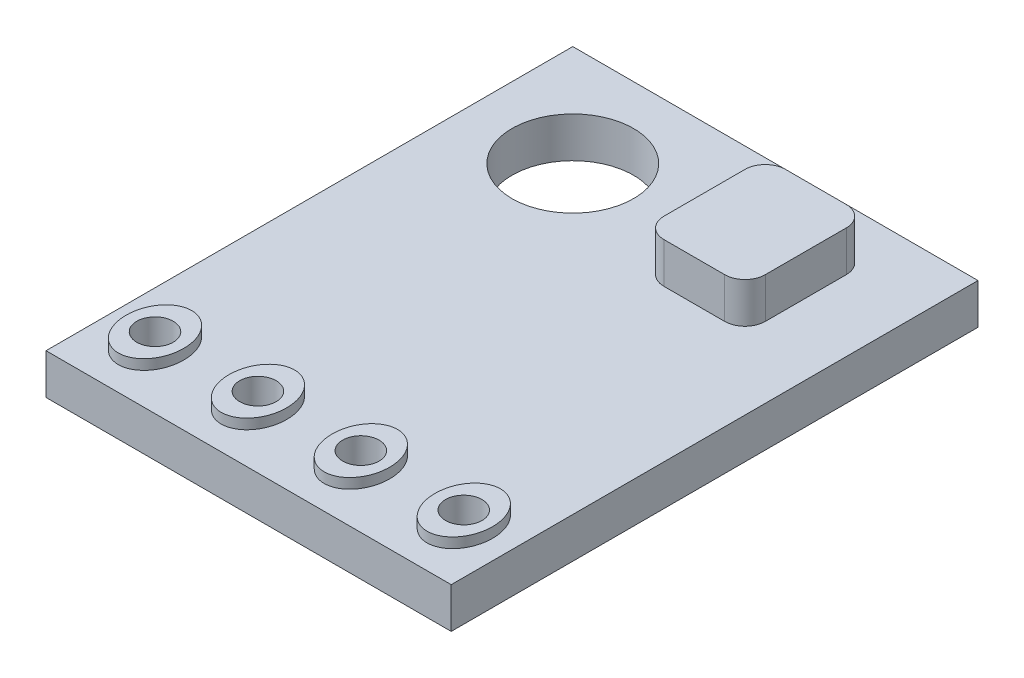
ISO-10303-21;
HEADER;
FILE_DESCRIPTION(('STEP AP214'),'2;1');
FILE_NAME('part.step','',(''),(''),'','','');
FILE_SCHEMA(('AUTOMOTIVE_DESIGN { 1 0 10303 214 1 1 1 1 }'));
ENDSEC;
DATA;
#1=APPLICATION_CONTEXT('core data for automotive mechanical design processes');
#2=APPLICATION_PROTOCOL_DEFINITION('international standard','automotive_design',2000,#1);
#3=PRODUCT_CONTEXT('',#1,'mechanical');
#4=PRODUCT('Part','Part','',(#3));
#5=PRODUCT_RELATED_PRODUCT_CATEGORY('part','',(#4));
#6=PRODUCT_DEFINITION_FORMATION('','',#4);
#7=PRODUCT_DEFINITION_CONTEXT('part definition',#1,'design');
#8=PRODUCT_DEFINITION('design','',#6,#7);
#9=PRODUCT_DEFINITION_SHAPE('','',#8);
#10=(LENGTH_UNIT() NAMED_UNIT(*) SI_UNIT(.MILLI.,.METRE.));
#11=(NAMED_UNIT(*) PLANE_ANGLE_UNIT() SI_UNIT($,.RADIAN.));
#12=(NAMED_UNIT(*) SI_UNIT($,.STERADIAN.) SOLID_ANGLE_UNIT());
#13=UNCERTAINTY_MEASURE_WITH_UNIT(LENGTH_MEASURE(1.E-05),#10,'distance_accuracy_value','');
#14=(GEOMETRIC_REPRESENTATION_CONTEXT(3) GLOBAL_UNCERTAINTY_ASSIGNED_CONTEXT((#13)) GLOBAL_UNIT_ASSIGNED_CONTEXT((#10,
#11,#12)) REPRESENTATION_CONTEXT('',''));
#15=CARTESIAN_POINT('',(0.,0.,0.));
#16=DIRECTION('',(0.,0.,1.));
#17=DIRECTION('',(1.,0.,0.));
#18=AXIS2_PLACEMENT_3D('',#15,#16,#17);
#19=CARTESIAN_POINT('',(0.,1.,0.));
#20=DIRECTION('',(0.,1.,0.));
#21=DIRECTION('',(0.,0.,1.));
#22=AXIS2_PLACEMENT_3D('',#19,#20,#21);
#23=PLANE('',#22);
#24=CARTESIAN_POINT('',(1.27,1.,5.));
#25=DIRECTION('',(0.,1.,0.));
#26=DIRECTION('',(0.,0.,1.));
#27=AXIS2_PLACEMENT_3D('',#24,#25,#26);
#28=ELLIPSE('',#27,0.905906642383663,0.710654865542892);
#29=CARTESIAN_POINT('',(1.27,1.,5.90590664238366));
#30=VERTEX_POINT('',#29);
#31=EDGE_CURVE('E376',#30,#30,#28,.F.);
#32=ORIENTED_EDGE('',*,*,#31,.T.);
#33=EDGE_LOOP('',(#32));
#34=FACE_BOUND('',#33,.T.);
#35=CARTESIAN_POINT('',(3.81,1.,5.));
#36=DIRECTION('',(0.,1.,0.));
#37=DIRECTION('',(0.,0.,1.));
#38=AXIS2_PLACEMENT_3D('',#35,#36,#37);
#39=ELLIPSE('',#38,0.905906642383663,0.710654865542892);
#40=CARTESIAN_POINT('',(3.81,1.,5.90590664238366));
#41=VERTEX_POINT('',#40);
#42=EDGE_CURVE('E402',#41,#41,#39,.F.);
#43=ORIENTED_EDGE('',*,*,#42,.T.);
#44=EDGE_LOOP('',(#43));
#45=FACE_BOUND('',#44,.T.);
#46=CARTESIAN_POINT('',(-1.27,1.,5.));
#47=DIRECTION('',(0.,1.,0.));
#48=DIRECTION('',(0.,0.,1.));
#49=AXIS2_PLACEMENT_3D('',#46,#47,#48);
#50=ELLIPSE('',#49,0.905906642383663,0.710654865542892);
#51=CARTESIAN_POINT('',(-1.27,1.,5.90590664238366));
#52=VERTEX_POINT('',#51);
#53=EDGE_CURVE('E334',#52,#52,#50,.F.);
#54=ORIENTED_EDGE('',*,*,#53,.T.);
#55=EDGE_LOOP('',(#54));
#56=FACE_BOUND('',#55,.T.);
#57=CARTESIAN_POINT('',(-3.81,1.,5.));
#58=DIRECTION('',(0.,1.,0.));
#59=DIRECTION('',(0.,0.,1.));
#60=AXIS2_PLACEMENT_3D('',#57,#58,#59);
#61=ELLIPSE('',#60,0.905906642383663,0.710654865542892);
#62=CARTESIAN_POINT('',(-3.81,1.,5.90590664238366));
#63=VERTEX_POINT('',#62);
#64=EDGE_CURVE('E158',#63,#63,#61,.F.);
#65=ORIENTED_EDGE('',*,*,#64,.T.);
#66=EDGE_LOOP('',(#65));
#67=FACE_BOUND('',#66,.T.);
#68=DIRECTION('',(0.,0.,-1.));
#69=VECTOR('',#68,1.);
#70=CARTESIAN_POINT('',(5.,1.,-6.5));
#71=LINE('',#70,#69);
#72=CARTESIAN_POINT('',(5.,1.,6.5));
#73=VERTEX_POINT('',#72);
#74=CARTESIAN_POINT('',(5.,1.,-6.5));
#75=VERTEX_POINT('',#74);
#76=EDGE_CURVE('E196',#73,#75,#71,.T.);
#77=ORIENTED_EDGE('',*,*,#76,.T.);
#78=DIRECTION('',(-1.,0.,0.));
#79=VECTOR('',#78,1.);
#80=CARTESIAN_POINT('',(-5.,1.,-6.5));
#81=LINE('',#80,#79);
#82=CARTESIAN_POINT('',(-5.,1.,-6.5));
#83=VERTEX_POINT('',#82);
#84=EDGE_CURVE('E92',#75,#83,#81,.T.);
#85=ORIENTED_EDGE('',*,*,#84,.T.);
#86=DIRECTION('',(0.,0.,1.));
#87=VECTOR('',#86,1.);
#88=CARTESIAN_POINT('',(-5.,1.,-6.5));
#89=LINE('',#88,#87);
#90=CARTESIAN_POINT('',(-5.,1.,6.5));
#91=VERTEX_POINT('',#90);
#92=EDGE_CURVE('E199',#83,#91,#89,.T.);
#93=ORIENTED_EDGE('',*,*,#92,.T.);
#94=DIRECTION('',(1.,0.,0.));
#95=VECTOR('',#94,1.);
#96=CARTESIAN_POINT('',(-5.,1.,6.5));
#97=LINE('',#96,#95);
#98=EDGE_CURVE('E64',#91,#73,#97,.T.);
#99=ORIENTED_EDGE('',*,*,#98,.T.);
#100=EDGE_LOOP('',(#77,#85,#93,#99));
#101=FACE_BOUND('',#100,.T.);
#102=CARTESIAN_POINT('',(-2.5,1.,-4.));
#103=DIRECTION('',(0.,1.,0.));
#104=DIRECTION('',(0.,0.,1.));
#105=AXIS2_PLACEMENT_3D('',#102,#103,#104);
#106=CIRCLE('',#105,1.5);
#107=CARTESIAN_POINT('',(-2.5,1.,-2.5));
#108=VERTEX_POINT('',#107);
#109=EDGE_CURVE('E190',#108,#108,#106,.T.);
#110=ORIENTED_EDGE('',*,*,#109,.F.);
#111=EDGE_LOOP('',(#110));
#112=FACE_BOUND('',#111,.T.);
#113=DIRECTION('',(-1.,0.,0.));
#114=VECTOR('',#113,1.);
#115=CARTESIAN_POINT('',(0.,1.,-2.5));
#116=LINE('',#115,#114);
#117=CARTESIAN_POINT('',(2.75,1.,-2.5));
#118=VERTEX_POINT('',#117);
#119=CARTESIAN_POINT('',(1.25,1.,-2.5));
#120=VERTEX_POINT('',#119);
#121=EDGE_CURVE('E186',#118,#120,#116,.T.);
#122=ORIENTED_EDGE('',*,*,#121,.T.);
#123=CARTESIAN_POINT('',(1.25,1.,-3.));
#124=DIRECTION('',(0.,1.,0.));
#125=DIRECTION('',(0.,0.,1.));
#126=AXIS2_PLACEMENT_3D('',#123,#124,#125);
#127=CIRCLE('',#126,0.5);
#128=CARTESIAN_POINT('',(0.749999999999998,1.,-3.));
#129=VERTEX_POINT('',#128);
#130=EDGE_CURVE('E162',#120,#129,#127,.F.);
#131=ORIENTED_EDGE('',*,*,#130,.T.);
#132=DIRECTION('',(0.,0.,-1.));
#133=VECTOR('',#132,1.);
#134=CARTESIAN_POINT('',(0.749999999999999,1.,0.));
#135=LINE('',#134,#133);
#136=CARTESIAN_POINT('',(0.749999999999998,1.,-5.));
#137=VERTEX_POINT('',#136);
#138=EDGE_CURVE('E163',#129,#137,#135,.T.);
#139=ORIENTED_EDGE('',*,*,#138,.T.);
#140=CARTESIAN_POINT('',(1.25,1.,-5.));
#141=DIRECTION('',(0.,1.,0.));
#142=DIRECTION('',(0.,0.,1.));
#143=AXIS2_PLACEMENT_3D('',#140,#141,#142);
#144=CIRCLE('',#143,0.5);
#145=CARTESIAN_POINT('',(1.25,1.,-5.5));
#146=VERTEX_POINT('',#145);
#147=EDGE_CURVE('E166',#137,#146,#144,.F.);
#148=ORIENTED_EDGE('',*,*,#147,.T.);
#149=DIRECTION('',(1.,0.,0.));
#150=VECTOR('',#149,1.);
#151=CARTESIAN_POINT('',(0.,1.,-5.5));
#152=LINE('',#151,#150);
#153=CARTESIAN_POINT('',(2.74999999999999,1.,-5.5));
#154=VERTEX_POINT('',#153);
#155=EDGE_CURVE('E174',#146,#154,#152,.T.);
#156=ORIENTED_EDGE('',*,*,#155,.T.);
#157=CARTESIAN_POINT('',(2.75,1.,-5.));
#158=DIRECTION('',(0.,1.,0.));
#159=DIRECTION('',(0.,0.,1.));
#160=AXIS2_PLACEMENT_3D('',#157,#158,#159);
#161=CIRCLE('',#160,0.5);
#162=CARTESIAN_POINT('',(3.25,1.,-5.));
#163=VERTEX_POINT('',#162);
#164=EDGE_CURVE('E177',#154,#163,#161,.F.);
#165=ORIENTED_EDGE('',*,*,#164,.T.);
#166=DIRECTION('',(0.,0.,1.));
#167=VECTOR('',#166,1.);
#168=CARTESIAN_POINT('',(3.25,1.,0.));
#169=LINE('',#168,#167);
#170=CARTESIAN_POINT('',(3.25,1.,-3.));
#171=VERTEX_POINT('',#170);
#172=EDGE_CURVE('E180',#163,#171,#169,.T.);
#173=ORIENTED_EDGE('',*,*,#172,.T.);
#174=CARTESIAN_POINT('',(2.75,1.,-3.));
#175=DIRECTION('',(0.,1.,0.));
#176=DIRECTION('',(0.,0.,1.));
#177=AXIS2_PLACEMENT_3D('',#174,#175,#176);
#178=CIRCLE('',#177,0.5);
#179=EDGE_CURVE('E183',#171,#118,#178,.F.);
#180=ORIENTED_EDGE('',*,*,#179,.T.);
#181=EDGE_LOOP('',(#122,#131,#139,#148,#156,#165,#173,#180));
#182=FACE_BOUND('',#181,.T.);
#183=ADVANCED_FACE('F40',(#34,#45,#56,#67,#101,#112,#182),#23,.T.);
#184=CARTESIAN_POINT('',(0.,0.,0.));
#185=DIRECTION('',(0.,1.,0.));
#186=DIRECTION('',(0.,0.,1.));
#187=AXIS2_PLACEMENT_3D('',#184,#185,#186);
#188=PLANE('',#187);
#189=CARTESIAN_POINT('',(-3.81,0.,5.));
#190=DIRECTION('',(0.,1.,0.));
#191=DIRECTION('',(0.,0.,1.));
#192=AXIS2_PLACEMENT_3D('',#189,#190,#191);
#193=CIRCLE('',#192,0.45);
#194=CARTESIAN_POINT('',(-3.81,0.,5.45));
#195=VERTEX_POINT('',#194);
#196=EDGE_CURVE('E361',#195,#195,#193,.F.);
#197=ORIENTED_EDGE('',*,*,#196,.F.);
#198=EDGE_LOOP('',(#197));
#199=FACE_BOUND('',#198,.T.);
#200=CARTESIAN_POINT('',(-1.27,0.,5.));
#201=DIRECTION('',(0.,1.,0.));
#202=DIRECTION('',(0.,0.,1.));
#203=AXIS2_PLACEMENT_3D('',#200,#201,#202);
#204=CIRCLE('',#203,0.45);
#205=CARTESIAN_POINT('',(-1.27,0.,5.45));
#206=VERTEX_POINT('',#205);
#207=EDGE_CURVE('E363',#206,#206,#204,.F.);
#208=ORIENTED_EDGE('',*,*,#207,.F.);
#209=EDGE_LOOP('',(#208));
#210=FACE_BOUND('',#209,.T.);
#211=CARTESIAN_POINT('',(1.27,0.,5.));
#212=DIRECTION('',(0.,1.,0.));
#213=DIRECTION('',(0.,0.,1.));
#214=AXIS2_PLACEMENT_3D('',#211,#212,#213);
#215=CIRCLE('',#214,0.45);
#216=CARTESIAN_POINT('',(1.27,0.,5.45));
#217=VERTEX_POINT('',#216);
#218=EDGE_CURVE('E418',#217,#217,#215,.F.);
#219=ORIENTED_EDGE('',*,*,#218,.F.);
#220=EDGE_LOOP('',(#219));
#221=FACE_BOUND('',#220,.T.);
#222=CARTESIAN_POINT('',(3.81,0.,5.));
#223=DIRECTION('',(0.,1.,0.));
#224=DIRECTION('',(0.,0.,1.));
#225=AXIS2_PLACEMENT_3D('',#222,#223,#224);
#226=CIRCLE('',#225,0.450000000000001);
#227=CARTESIAN_POINT('',(3.81,0.,5.45));
#228=VERTEX_POINT('',#227);
#229=EDGE_CURVE('E369',#228,#228,#226,.F.);
#230=ORIENTED_EDGE('',*,*,#229,.F.);
#231=EDGE_LOOP('',(#230));
#232=FACE_BOUND('',#231,.T.);
#233=CARTESIAN_POINT('',(-2.5,0.,-4.));
#234=DIRECTION('',(0.,1.,0.));
#235=DIRECTION('',(0.,0.,1.));
#236=AXIS2_PLACEMENT_3D('',#233,#234,#235);
#237=CIRCLE('',#236,1.5);
#238=CARTESIAN_POINT('',(-2.5,0.,-2.5));
#239=VERTEX_POINT('',#238);
#240=EDGE_CURVE('E189',#239,#239,#237,.T.);
#241=ORIENTED_EDGE('',*,*,#240,.T.);
#242=EDGE_LOOP('',(#241));
#243=FACE_BOUND('',#242,.T.);
#244=DIRECTION('',(0.,0.,-1.));
#245=VECTOR('',#244,1.);
#246=CARTESIAN_POINT('',(5.,0.,-6.5));
#247=LINE('',#246,#245);
#248=CARTESIAN_POINT('',(5.,0.,6.5));
#249=VERTEX_POINT('',#248);
#250=CARTESIAN_POINT('',(5.,0.,-6.5));
#251=VERTEX_POINT('',#250);
#252=EDGE_CURVE('E193',#249,#251,#247,.T.);
#253=ORIENTED_EDGE('',*,*,#252,.F.);
#254=DIRECTION('',(1.,0.,0.));
#255=VECTOR('',#254,1.);
#256=CARTESIAN_POINT('',(-5.,0.,6.5));
#257=LINE('',#256,#255);
#258=CARTESIAN_POINT('',(-5.,0.,6.5));
#259=VERTEX_POINT('',#258);
#260=EDGE_CURVE('E85',#259,#249,#257,.T.);
#261=ORIENTED_EDGE('',*,*,#260,.F.);
#262=DIRECTION('',(0.,0.,1.));
#263=VECTOR('',#262,1.);
#264=CARTESIAN_POINT('',(-5.,0.,-6.5));
#265=LINE('',#264,#263);
#266=CARTESIAN_POINT('',(-5.,0.,-6.5));
#267=VERTEX_POINT('',#266);
#268=EDGE_CURVE('E207',#267,#259,#265,.T.);
#269=ORIENTED_EDGE('',*,*,#268,.F.);
#270=DIRECTION('',(-1.,0.,0.));
#271=VECTOR('',#270,1.);
#272=CARTESIAN_POINT('',(-5.,0.,-6.5));
#273=LINE('',#272,#271);
#274=EDGE_CURVE('E205',#251,#267,#273,.T.);
#275=ORIENTED_EDGE('',*,*,#274,.F.);
#276=EDGE_LOOP('',(#253,#261,#269,#275));
#277=FACE_BOUND('',#276,.T.);
#278=ADVANCED_FACE('F220',(#199,#210,#221,#232,#243,#277),#188,.F.);
#279=CARTESIAN_POINT('',(5.,1.,-6.5));
#280=DIRECTION('',(-1.,0.,0.));
#281=DIRECTION('',(0.,0.,1.));
#282=AXIS2_PLACEMENT_3D('',#279,#280,#281);
#283=PLANE('',#282);
#284=ORIENTED_EDGE('',*,*,#252,.T.);
#285=DIRECTION('',(0.,-1.,0.));
#286=VECTOR('',#285,1.);
#287=CARTESIAN_POINT('',(5.,1.,-6.5));
#288=LINE('',#287,#286);
#289=EDGE_CURVE('E11',#75,#251,#288,.T.);
#290=ORIENTED_EDGE('',*,*,#289,.F.);
#291=ORIENTED_EDGE('',*,*,#76,.F.);
#292=DIRECTION('',(0.,-1.,0.));
#293=VECTOR('',#292,1.);
#294=CARTESIAN_POINT('',(5.,1.,6.5));
#295=LINE('',#294,#293);
#296=EDGE_CURVE('E202',#73,#249,#295,.T.);
#297=ORIENTED_EDGE('',*,*,#296,.T.);
#298=EDGE_LOOP('',(#284,#290,#291,#297));
#299=FACE_BOUND('',#298,.T.);
#300=ADVANCED_FACE('F42',(#299),#283,.F.);
#301=CARTESIAN_POINT('',(-5.,1.,-6.5));
#302=DIRECTION('',(0.,0.,1.));
#303=DIRECTION('',(1.,0.,0.));
#304=AXIS2_PLACEMENT_3D('',#301,#302,#303);
#305=PLANE('',#304);
#306=ORIENTED_EDGE('',*,*,#274,.T.);
#307=DIRECTION('',(0.,-1.,0.));
#308=VECTOR('',#307,1.);
#309=CARTESIAN_POINT('',(-5.,1.,-6.5));
#310=LINE('',#309,#308);
#311=EDGE_CURVE('E48',#83,#267,#310,.T.);
#312=ORIENTED_EDGE('',*,*,#311,.F.);
#313=ORIENTED_EDGE('',*,*,#84,.F.);
#314=ORIENTED_EDGE('',*,*,#289,.T.);
#315=EDGE_LOOP('',(#306,#312,#313,#314));
#316=FACE_BOUND('',#315,.T.);
#317=ADVANCED_FACE('F234',(#316),#305,.F.);
#318=CARTESIAN_POINT('',(-5.,1.,-6.5));
#319=DIRECTION('',(1.,0.,0.));
#320=DIRECTION('',(0.,0.,-1.));
#321=AXIS2_PLACEMENT_3D('',#318,#319,#320);
#322=PLANE('',#321);
#323=ORIENTED_EDGE('',*,*,#268,.T.);
#324=DIRECTION('',(0.,-1.,0.));
#325=VECTOR('',#324,1.);
#326=CARTESIAN_POINT('',(-5.,1.,6.5));
#327=LINE('',#326,#325);
#328=EDGE_CURVE('E211',#91,#259,#327,.T.);
#329=ORIENTED_EDGE('',*,*,#328,.F.);
#330=ORIENTED_EDGE('',*,*,#92,.F.);
#331=ORIENTED_EDGE('',*,*,#311,.T.);
#332=EDGE_LOOP('',(#323,#329,#330,#331));
#333=FACE_BOUND('',#332,.T.);
#334=ADVANCED_FACE('F216',(#333),#322,.F.);
#335=CARTESIAN_POINT('',(-5.,1.,6.5));
#336=DIRECTION('',(0.,0.,-1.));
#337=DIRECTION('',(-1.,0.,0.));
#338=AXIS2_PLACEMENT_3D('',#335,#336,#337);
#339=PLANE('',#338);
#340=ORIENTED_EDGE('',*,*,#260,.T.);
#341=ORIENTED_EDGE('',*,*,#296,.F.);
#342=ORIENTED_EDGE('',*,*,#98,.F.);
#343=ORIENTED_EDGE('',*,*,#328,.T.);
#344=EDGE_LOOP('',(#340,#341,#342,#343));
#345=FACE_BOUND('',#344,.T.);
#346=ADVANCED_FACE('F224',(#345),#339,.F.);
#347=CARTESIAN_POINT('',(-2.5,1.,-4.));
#348=DIRECTION('',(0.,-1.,0.));
#349=DIRECTION('',(0.,0.,-1.));
#350=AXIS2_PLACEMENT_3D('',#347,#348,#349);
#351=CYLINDRICAL_SURFACE('',#350,1.5);
#352=ORIENTED_EDGE('',*,*,#109,.T.);
#353=EDGE_LOOP('',(#352));
#354=FACE_BOUND('',#353,.T.);
#355=ORIENTED_EDGE('',*,*,#240,.F.);
#356=EDGE_LOOP('',(#355));
#357=FACE_BOUND('',#356,.T.);
#358=ADVANCED_FACE('F226',(#354,#357),#351,.F.);
#359=CARTESIAN_POINT('',(1.25,2.,-3.));
#360=DIRECTION('',(0.,-1.,0.));
#361=DIRECTION('',(0.,0.,-1.));
#362=AXIS2_PLACEMENT_3D('',#359,#360,#361);
#363=CYLINDRICAL_SURFACE('',#362,0.5);
#364=ORIENTED_EDGE('',*,*,#130,.F.);
#365=DIRECTION('',(0.,-1.,0.));
#366=VECTOR('',#365,1.);
#367=CARTESIAN_POINT('',(1.25,2.,-2.5));
#368=LINE('',#367,#366);
#369=CARTESIAN_POINT('',(1.25,2.,-2.5));
#370=VERTEX_POINT('',#369);
#371=EDGE_CURVE('E143',#370,#120,#368,.T.);
#372=ORIENTED_EDGE('',*,*,#371,.F.);
#373=CARTESIAN_POINT('',(1.25,2.,-3.));
#374=DIRECTION('',(0.,1.,0.));
#375=DIRECTION('',(0.,0.,-1.));
#376=AXIS2_PLACEMENT_3D('',#373,#374,#375);
#377=CIRCLE('',#376,0.5);
#378=CARTESIAN_POINT('',(0.749999999999998,2.,-3.));
#379=VERTEX_POINT('',#378);
#380=EDGE_CURVE('E150',#379,#370,#377,.T.);
#381=ORIENTED_EDGE('',*,*,#380,.F.);
#382=DIRECTION('',(0.,-1.,0.));
#383=VECTOR('',#382,1.);
#384=CARTESIAN_POINT('',(0.749999999999998,2.,-3.));
#385=LINE('',#384,#383);
#386=EDGE_CURVE('E303',#379,#129,#385,.T.);
#387=ORIENTED_EDGE('',*,*,#386,.T.);
#388=EDGE_LOOP('',(#364,#372,#381,#387));
#389=FACE_BOUND('',#388,.T.);
#390=ADVANCED_FACE('F160',(#389),#363,.T.);
#391=CARTESIAN_POINT('',(1.25,2.,-2.5));
#392=DIRECTION('',(0.,0.,-1.));
#393=DIRECTION('',(-1.,0.,0.));
#394=AXIS2_PLACEMENT_3D('',#391,#392,#393);
#395=PLANE('',#394);
#396=ORIENTED_EDGE('',*,*,#121,.F.);
#397=DIRECTION('',(0.,-1.,0.));
#398=VECTOR('',#397,1.);
#399=CARTESIAN_POINT('',(2.75,2.,-2.5));
#400=LINE('',#399,#398);
#401=CARTESIAN_POINT('',(2.75,2.,-2.5));
#402=VERTEX_POINT('',#401);
#403=EDGE_CURVE('E146',#402,#118,#400,.T.);
#404=ORIENTED_EDGE('',*,*,#403,.F.);
#405=DIRECTION('',(1.,0.,0.));
#406=VECTOR('',#405,1.);
#407=CARTESIAN_POINT('',(1.25,2.,-2.5));
#408=LINE('',#407,#406);
#409=EDGE_CURVE('E139',#370,#402,#408,.T.);
#410=ORIENTED_EDGE('',*,*,#409,.F.);
#411=ORIENTED_EDGE('',*,*,#371,.T.);
#412=EDGE_LOOP('',(#396,#404,#410,#411));
#413=FACE_BOUND('',#412,.T.);
#414=ADVANCED_FACE('F141',(#413),#395,.F.);
#415=CARTESIAN_POINT('',(2.75,2.,-3.));
#416=DIRECTION('',(0.,-1.,0.));
#417=DIRECTION('',(0.,0.,-1.));
#418=AXIS2_PLACEMENT_3D('',#415,#416,#417);
#419=CYLINDRICAL_SURFACE('',#418,0.5);
#420=ORIENTED_EDGE('',*,*,#179,.F.);
#421=DIRECTION('',(0.,-1.,0.));
#422=VECTOR('',#421,1.);
#423=CARTESIAN_POINT('',(3.25,2.,-3.));
#424=LINE('',#423,#422);
#425=CARTESIAN_POINT('',(3.25,2.,-3.));
#426=VERTEX_POINT('',#425);
#427=EDGE_CURVE('E168',#426,#171,#424,.T.);
#428=ORIENTED_EDGE('',*,*,#427,.F.);
#429=CARTESIAN_POINT('',(2.75,2.,-3.));
#430=DIRECTION('',(0.,1.,0.));
#431=DIRECTION('',(0.,0.,1.));
#432=AXIS2_PLACEMENT_3D('',#429,#430,#431);
#433=CIRCLE('',#432,0.5);
#434=EDGE_CURVE('E149',#402,#426,#433,.T.);
#435=ORIENTED_EDGE('',*,*,#434,.F.);
#436=ORIENTED_EDGE('',*,*,#403,.T.);
#437=EDGE_LOOP('',(#420,#428,#435,#436));
#438=FACE_BOUND('',#437,.T.);
#439=ADVANCED_FACE('F251',(#438),#419,.T.);
#440=CARTESIAN_POINT('',(3.25,2.,-5.));
#441=DIRECTION('',(-1.,0.,0.));
#442=DIRECTION('',(0.,0.,1.));
#443=AXIS2_PLACEMENT_3D('',#440,#441,#442);
#444=PLANE('',#443);
#445=ORIENTED_EDGE('',*,*,#172,.F.);
#446=DIRECTION('',(0.,-1.,0.));
#447=VECTOR('',#446,1.);
#448=CARTESIAN_POINT('',(3.25,2.,-5.));
#449=LINE('',#448,#447);
#450=CARTESIAN_POINT('',(3.25,2.,-5.));
#451=VERTEX_POINT('',#450);
#452=EDGE_CURVE('E312',#451,#163,#449,.T.);
#453=ORIENTED_EDGE('',*,*,#452,.F.);
#454=DIRECTION('',(0.,0.,-1.));
#455=VECTOR('',#454,1.);
#456=CARTESIAN_POINT('',(3.25,2.,-5.));
#457=LINE('',#456,#455);
#458=EDGE_CURVE('E294',#426,#451,#457,.T.);
#459=ORIENTED_EDGE('',*,*,#458,.F.);
#460=ORIENTED_EDGE('',*,*,#427,.T.);
#461=EDGE_LOOP('',(#445,#453,#459,#460));
#462=FACE_BOUND('',#461,.T.);
#463=ADVANCED_FACE('F254',(#462),#444,.F.);
#464=CARTESIAN_POINT('',(2.75,2.,-5.));
#465=DIRECTION('',(0.,-1.,0.));
#466=DIRECTION('',(0.,0.,-1.));
#467=AXIS2_PLACEMENT_3D('',#464,#465,#466);
#468=CYLINDRICAL_SURFACE('',#467,0.5);
#469=ORIENTED_EDGE('',*,*,#164,.F.);
#470=DIRECTION('',(0.,-1.,0.));
#471=VECTOR('',#470,1.);
#472=CARTESIAN_POINT('',(2.74999999999999,2.,-5.5));
#473=LINE('',#472,#471);
#474=CARTESIAN_POINT('',(2.74999999999999,2.,-5.5));
#475=VERTEX_POINT('',#474);
#476=EDGE_CURVE('E309',#475,#154,#473,.T.);
#477=ORIENTED_EDGE('',*,*,#476,.F.);
#478=CARTESIAN_POINT('',(2.75,2.,-5.));
#479=DIRECTION('',(0.,1.,0.));
#480=DIRECTION('',(0.,0.,1.));
#481=AXIS2_PLACEMENT_3D('',#478,#479,#480);
#482=CIRCLE('',#481,0.5);
#483=EDGE_CURVE('E296',#451,#475,#482,.T.);
#484=ORIENTED_EDGE('',*,*,#483,.F.);
#485=ORIENTED_EDGE('',*,*,#452,.T.);
#486=EDGE_LOOP('',(#469,#477,#484,#485));
#487=FACE_BOUND('',#486,.T.);
#488=ADVANCED_FACE('F258',(#487),#468,.T.);
#489=CARTESIAN_POINT('',(1.25,2.,-5.5));
#490=DIRECTION('',(0.,0.,1.));
#491=DIRECTION('',(1.,0.,0.));
#492=AXIS2_PLACEMENT_3D('',#489,#490,#491);
#493=PLANE('',#492);
#494=ORIENTED_EDGE('',*,*,#155,.F.);
#495=DIRECTION('',(0.,-1.,0.));
#496=VECTOR('',#495,1.);
#497=CARTESIAN_POINT('',(1.25,2.,-5.5));
#498=LINE('',#497,#496);
#499=CARTESIAN_POINT('',(1.25,2.,-5.5));
#500=VERTEX_POINT('',#499);
#501=EDGE_CURVE('E306',#500,#146,#498,.T.);
#502=ORIENTED_EDGE('',*,*,#501,.F.);
#503=DIRECTION('',(-1.,0.,0.));
#504=VECTOR('',#503,1.);
#505=CARTESIAN_POINT('',(1.25,2.,-5.5));
#506=LINE('',#505,#504);
#507=EDGE_CURVE('E298',#475,#500,#506,.T.);
#508=ORIENTED_EDGE('',*,*,#507,.F.);
#509=ORIENTED_EDGE('',*,*,#476,.T.);
#510=EDGE_LOOP('',(#494,#502,#508,#509));
#511=FACE_BOUND('',#510,.T.);
#512=ADVANCED_FACE('F262',(#511),#493,.F.);
#513=CARTESIAN_POINT('',(1.25,2.,-5.));
#514=DIRECTION('',(0.,-1.,0.));
#515=DIRECTION('',(0.,0.,-1.));
#516=AXIS2_PLACEMENT_3D('',#513,#514,#515);
#517=CYLINDRICAL_SURFACE('',#516,0.5);
#518=ORIENTED_EDGE('',*,*,#147,.F.);
#519=DIRECTION('',(0.,-1.,0.));
#520=VECTOR('',#519,1.);
#521=CARTESIAN_POINT('',(0.749999999999998,2.,-5.));
#522=LINE('',#521,#520);
#523=CARTESIAN_POINT('',(0.749999999999998,2.,-5.));
#524=VERTEX_POINT('',#523);
#525=EDGE_CURVE('E55',#524,#137,#522,.T.);
#526=ORIENTED_EDGE('',*,*,#525,.F.);
#527=CARTESIAN_POINT('',(1.25,2.,-5.));
#528=DIRECTION('',(0.,1.,0.));
#529=DIRECTION('',(0.,0.,-1.));
#530=AXIS2_PLACEMENT_3D('',#527,#528,#529);
#531=CIRCLE('',#530,0.5);
#532=EDGE_CURVE('E300',#500,#524,#531,.T.);
#533=ORIENTED_EDGE('',*,*,#532,.F.);
#534=ORIENTED_EDGE('',*,*,#501,.T.);
#535=EDGE_LOOP('',(#518,#526,#533,#534));
#536=FACE_BOUND('',#535,.T.);
#537=ADVANCED_FACE('F266',(#536),#517,.T.);
#538=CARTESIAN_POINT('',(0.749999999999998,2.,-5.));
#539=DIRECTION('',(1.,0.,0.));
#540=DIRECTION('',(0.,0.,-1.));
#541=AXIS2_PLACEMENT_3D('',#538,#539,#540);
#542=PLANE('',#541);
#543=ORIENTED_EDGE('',*,*,#138,.F.);
#544=ORIENTED_EDGE('',*,*,#386,.F.);
#545=DIRECTION('',(0.,0.,1.));
#546=VECTOR('',#545,1.);
#547=CARTESIAN_POINT('',(0.749999999999998,2.,-5.));
#548=LINE('',#547,#546);
#549=EDGE_CURVE('E154',#524,#379,#548,.T.);
#550=ORIENTED_EDGE('',*,*,#549,.F.);
#551=ORIENTED_EDGE('',*,*,#525,.T.);
#552=EDGE_LOOP('',(#543,#544,#550,#551));
#553=FACE_BOUND('',#552,.T.);
#554=ADVANCED_FACE('F270',(#553),#542,.F.);
#555=CARTESIAN_POINT('',(1.25,2.,-3.));
#556=DIRECTION('',(0.,-1.,0.));
#557=DIRECTION('',(0.,0.,-1.));
#558=AXIS2_PLACEMENT_3D('',#555,#556,#557);
#559=PLANE('',#558);
#560=ORIENTED_EDGE('',*,*,#380,.T.);
#561=ORIENTED_EDGE('',*,*,#409,.T.);
#562=ORIENTED_EDGE('',*,*,#434,.T.);
#563=ORIENTED_EDGE('',*,*,#458,.T.);
#564=ORIENTED_EDGE('',*,*,#483,.T.);
#565=ORIENTED_EDGE('',*,*,#507,.T.);
#566=ORIENTED_EDGE('',*,*,#532,.T.);
#567=ORIENTED_EDGE('',*,*,#549,.T.);
#568=EDGE_LOOP('',(#560,#561,#562,#563,#564,#565,#566,#567));
#569=FACE_BOUND('',#568,.T.);
#570=ADVANCED_FACE('F153',(#569),#559,.F.);
#571=CARTESIAN_POINT('',(-3.81,1.25,5.));
#572=DIRECTION('',(0.,1.,0.));
#573=DIRECTION('',(0.,0.,1.));
#574=AXIS2_PLACEMENT_3D('',#571,#572,#573);
#575=PLANE('',#574);
#576=CARTESIAN_POINT('',(-3.81,1.25,5.));
#577=DIRECTION('',(0.,1.,0.));
#578=DIRECTION('',(0.,0.,1.));
#579=AXIS2_PLACEMENT_3D('',#576,#577,#578);
#580=ELLIPSE('',#579,0.905906642383663,0.710654865542892);
#581=CARTESIAN_POINT('',(-3.81,1.25,5.90590664238366));
#582=VERTEX_POINT('',#581);
#583=EDGE_CURVE('E284',#582,#582,#580,.T.);
#584=ORIENTED_EDGE('',*,*,#583,.T.);
#585=EDGE_LOOP('',(#584));
#586=FACE_BOUND('',#585,.T.);
#587=CARTESIAN_POINT('',(-3.81,1.25,5.));
#588=DIRECTION('',(0.,1.,0.));
#589=DIRECTION('',(0.,0.,1.));
#590=AXIS2_PLACEMENT_3D('',#587,#588,#589);
#591=CIRCLE('',#590,0.45);
#592=CARTESIAN_POINT('',(-3.81,1.25,5.45));
#593=VERTEX_POINT('',#592);
#594=EDGE_CURVE('E289',#593,#593,#591,.T.);
#595=ORIENTED_EDGE('',*,*,#594,.F.);
#596=EDGE_LOOP('',(#595));
#597=FACE_BOUND('',#596,.T.);
#598=ADVANCED_FACE('F276',(#586,#597),#575,.T.);
#599=DIRECTION('',(0.,-1.,0.));
#600=VECTOR('',#599,1.);
#601=SURFACE_OF_LINEAR_EXTRUSION('',#580,#600);
#602=ORIENTED_EDGE('',*,*,#64,.F.);
#603=EDGE_LOOP('',(#602));
#604=FACE_BOUND('',#603,.T.);
#605=ORIENTED_EDGE('',*,*,#583,.F.);
#606=EDGE_LOOP('',(#605));
#607=FACE_BOUND('',#606,.T.);
#608=ADVANCED_FACE('F277',(#604,#607),#601,.F.);
#609=CARTESIAN_POINT('',(-3.81,1.25,5.));
#610=DIRECTION('',(0.,-1.,0.));
#611=DIRECTION('',(0.,0.,-1.));
#612=AXIS2_PLACEMENT_3D('',#609,#610,#611);
#613=CYLINDRICAL_SURFACE('',#612,0.45);
#614=ORIENTED_EDGE('',*,*,#594,.T.);
#615=EDGE_LOOP('',(#614));
#616=FACE_BOUND('',#615,.T.);
#617=ORIENTED_EDGE('',*,*,#196,.T.);
#618=EDGE_LOOP('',(#617));
#619=FACE_BOUND('',#618,.T.);
#620=ADVANCED_FACE('F281',(#616,#619),#613,.F.);
#621=CARTESIAN_POINT('',(-1.27,1.25,5.));
#622=DIRECTION('',(0.,1.,0.));
#623=DIRECTION('',(0.,0.,1.));
#624=AXIS2_PLACEMENT_3D('',#621,#622,#623);
#625=PLANE('',#624);
#626=CARTESIAN_POINT('',(-1.27,1.25,5.));
#627=DIRECTION('',(0.,1.,0.));
#628=DIRECTION('',(0.,0.,1.));
#629=AXIS2_PLACEMENT_3D('',#626,#627,#628);
#630=ELLIPSE('',#629,0.905906642383663,0.710654865542892);
#631=CARTESIAN_POINT('',(-1.27,1.25,5.90590664238366));
#632=VERTEX_POINT('',#631);
#633=EDGE_CURVE('E336',#632,#632,#630,.T.);
#634=ORIENTED_EDGE('',*,*,#633,.T.);
#635=EDGE_LOOP('',(#634));
#636=FACE_BOUND('',#635,.T.);
#637=CARTESIAN_POINT('',(-1.27,1.25,5.));
#638=DIRECTION('',(0.,1.,0.));
#639=DIRECTION('',(0.,0.,1.));
#640=AXIS2_PLACEMENT_3D('',#637,#638,#639);
#641=CIRCLE('',#640,0.45);
#642=CARTESIAN_POINT('',(-1.27,1.25,5.45));
#643=VERTEX_POINT('',#642);
#644=EDGE_CURVE('E340',#643,#643,#641,.T.);
#645=ORIENTED_EDGE('',*,*,#644,.F.);
#646=EDGE_LOOP('',(#645));
#647=FACE_BOUND('',#646,.T.);
#648=ADVANCED_FACE('F350',(#636,#647),#625,.T.);
#649=DIRECTION('',(0.,-1.,0.));
#650=VECTOR('',#649,1.);
#651=SURFACE_OF_LINEAR_EXTRUSION('',#630,#650);
#652=ORIENTED_EDGE('',*,*,#53,.F.);
#653=EDGE_LOOP('',(#652));
#654=FACE_BOUND('',#653,.T.);
#655=ORIENTED_EDGE('',*,*,#633,.F.);
#656=EDGE_LOOP('',(#655));
#657=FACE_BOUND('',#656,.T.);
#658=ADVANCED_FACE('F346',(#654,#657),#651,.F.);
#659=CARTESIAN_POINT('',(-1.27,1.25,5.));
#660=DIRECTION('',(0.,-1.,0.));
#661=DIRECTION('',(0.,0.,-1.));
#662=AXIS2_PLACEMENT_3D('',#659,#660,#661);
#663=CYLINDRICAL_SURFACE('',#662,0.45);
#664=ORIENTED_EDGE('',*,*,#644,.T.);
#665=EDGE_LOOP('',(#664));
#666=FACE_BOUND('',#665,.T.);
#667=ORIENTED_EDGE('',*,*,#207,.T.);
#668=EDGE_LOOP('',(#667));
#669=FACE_BOUND('',#668,.T.);
#670=ADVANCED_FACE('F349',(#666,#669),#663,.F.);
#671=CARTESIAN_POINT('',(3.81,1.25,5.));
#672=DIRECTION('',(0.,-1.,0.));
#673=DIRECTION('',(0.,0.,-1.));
#674=AXIS2_PLACEMENT_3D('',#671,#672,#673);
#675=PLANE('',#674);
#676=CARTESIAN_POINT('',(3.81,1.25,5.));
#677=DIRECTION('',(0.,1.,0.));
#678=DIRECTION('',(0.,0.,1.));
#679=AXIS2_PLACEMENT_3D('',#676,#677,#678);
#680=ELLIPSE('',#679,0.905906642383663,0.710654865542892);
#681=CARTESIAN_POINT('',(3.81,1.25,5.90590664238366));
#682=VERTEX_POINT('',#681);
#683=EDGE_CURVE('E399',#682,#682,#680,.T.);
#684=ORIENTED_EDGE('',*,*,#683,.T.);
#685=EDGE_LOOP('',(#684));
#686=FACE_BOUND('',#685,.T.);
#687=CARTESIAN_POINT('',(3.81,1.25,5.));
#688=DIRECTION('',(0.,1.,0.));
#689=DIRECTION('',(0.,0.,-1.));
#690=AXIS2_PLACEMENT_3D('',#687,#688,#689);
#691=CIRCLE('',#690,0.45);
#692=CARTESIAN_POINT('',(3.81,1.25,4.55));
#693=VERTEX_POINT('',#692);
#694=EDGE_CURVE('E403',#693,#693,#691,.T.);
#695=ORIENTED_EDGE('',*,*,#694,.F.);
#696=EDGE_LOOP('',(#695));
#697=FACE_BOUND('',#696,.T.);
#698=ADVANCED_FACE('F392',(#686,#697),#675,.F.);
#699=DIRECTION('',(0.,-1.,0.));
#700=VECTOR('',#699,1.);
#701=SURFACE_OF_LINEAR_EXTRUSION('',#680,#700);
#702=ORIENTED_EDGE('',*,*,#42,.F.);
#703=EDGE_LOOP('',(#702));
#704=FACE_BOUND('',#703,.T.);
#705=ORIENTED_EDGE('',*,*,#683,.F.);
#706=EDGE_LOOP('',(#705));
#707=FACE_BOUND('',#706,.T.);
#708=ADVANCED_FACE('F390',(#704,#707),#701,.F.);
#709=CARTESIAN_POINT('',(3.81,1.25,5.));
#710=DIRECTION('',(0.,-1.,0.));
#711=DIRECTION('',(0.,0.,-1.));
#712=AXIS2_PLACEMENT_3D('',#709,#710,#711);
#713=CYLINDRICAL_SURFACE('',#712,0.45);
#714=ORIENTED_EDGE('',*,*,#694,.T.);
#715=EDGE_LOOP('',(#714));
#716=FACE_BOUND('',#715,.T.);
#717=ORIENTED_EDGE('',*,*,#229,.T.);
#718=EDGE_LOOP('',(#717));
#719=FACE_BOUND('',#718,.T.);
#720=ADVANCED_FACE('F387',(#716,#719),#713,.F.);
#721=CARTESIAN_POINT('',(1.27,1.25,5.));
#722=DIRECTION('',(0.,-1.,0.));
#723=DIRECTION('',(0.,0.,-1.));
#724=AXIS2_PLACEMENT_3D('',#721,#722,#723);
#725=PLANE('',#724);
#726=CARTESIAN_POINT('',(1.27,1.25,5.));
#727=DIRECTION('',(0.,1.,0.));
#728=DIRECTION('',(0.,0.,1.));
#729=AXIS2_PLACEMENT_3D('',#726,#727,#728);
#730=ELLIPSE('',#729,0.905906642383663,0.710654865542892);
#731=CARTESIAN_POINT('',(1.27,1.25,5.90590664238366));
#732=VERTEX_POINT('',#731);
#733=EDGE_CURVE('E366',#732,#732,#730,.T.);
#734=ORIENTED_EDGE('',*,*,#733,.T.);
#735=EDGE_LOOP('',(#734));
#736=FACE_BOUND('',#735,.T.);
#737=CARTESIAN_POINT('',(1.27,1.25,5.));
#738=DIRECTION('',(0.,1.,0.));
#739=DIRECTION('',(0.,0.,-1.));
#740=AXIS2_PLACEMENT_3D('',#737,#738,#739);
#741=CIRCLE('',#740,0.45);
#742=CARTESIAN_POINT('',(1.27,1.25,4.55));
#743=VERTEX_POINT('',#742);
#744=EDGE_CURVE('E362',#743,#743,#741,.T.);
#745=ORIENTED_EDGE('',*,*,#744,.F.);
#746=EDGE_LOOP('',(#745));
#747=FACE_BOUND('',#746,.T.);
#748=ADVANCED_FACE('F384',(#736,#747),#725,.F.);
#749=DIRECTION('',(0.,-1.,0.));
#750=VECTOR('',#749,1.);
#751=SURFACE_OF_LINEAR_EXTRUSION('',#730,#750);
#752=ORIENTED_EDGE('',*,*,#31,.F.);
#753=EDGE_LOOP('',(#752));
#754=FACE_BOUND('',#753,.T.);
#755=ORIENTED_EDGE('',*,*,#733,.F.);
#756=EDGE_LOOP('',(#755));
#757=FACE_BOUND('',#756,.T.);
#758=ADVANCED_FACE('F379',(#754,#757),#751,.F.);
#759=CARTESIAN_POINT('',(1.27,1.25,5.));
#760=DIRECTION('',(0.,-1.,0.));
#761=DIRECTION('',(0.,0.,-1.));
#762=AXIS2_PLACEMENT_3D('',#759,#760,#761);
#763=CYLINDRICAL_SURFACE('',#762,0.45);
#764=ORIENTED_EDGE('',*,*,#744,.T.);
#765=EDGE_LOOP('',(#764));
#766=FACE_BOUND('',#765,.T.);
#767=ORIENTED_EDGE('',*,*,#218,.T.);
#768=EDGE_LOOP('',(#767));
#769=FACE_BOUND('',#768,.T.);
#770=ADVANCED_FACE('F383',(#766,#769),#763,.F.);
#771=CLOSED_SHELL('',(#183,#278,#300,#317,#334,#346,#358,#390,#414,#439,#463,#488,#512,#537,
#554,#570,#598,#608,#620,#648,#658,#670,#698,#708,#720,#748,#758,#770));
#772=MANIFOLD_SOLID_BREP('B2',#771);
#773=ADVANCED_BREP_SHAPE_REPRESENTATION('',(#18,#772),#14);
#774=SHAPE_DEFINITION_REPRESENTATION(#9,#773);
ENDSEC;
END-ISO-10303-21;
